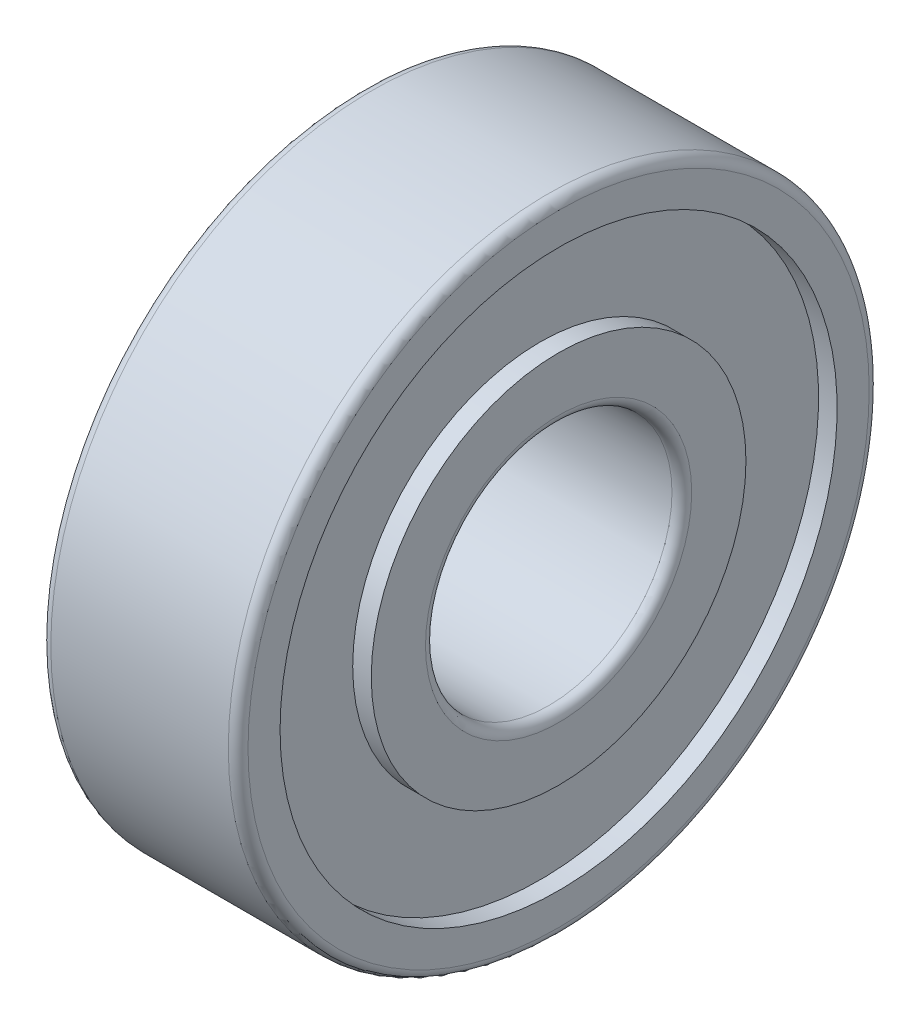
ISO-10303-21;
HEADER;
FILE_DESCRIPTION(('STEP AP214'),'2;1');
FILE_NAME('part.step','',(''),(''),'','','');
FILE_SCHEMA(('AUTOMOTIVE_DESIGN { 1 0 10303 214 1 1 1 1 }'));
ENDSEC;
DATA;
#1=APPLICATION_CONTEXT('core data for automotive mechanical design processes');
#2=APPLICATION_PROTOCOL_DEFINITION('international standard','automotive_design',2000,#1);
#3=PRODUCT_CONTEXT('',#1,'mechanical');
#4=PRODUCT('Part','Part','',(#3));
#5=PRODUCT_RELATED_PRODUCT_CATEGORY('part','',(#4));
#6=PRODUCT_DEFINITION_FORMATION('','',#4);
#7=PRODUCT_DEFINITION_CONTEXT('part definition',#1,'design');
#8=PRODUCT_DEFINITION('design','',#6,#7);
#9=PRODUCT_DEFINITION_SHAPE('','',#8);
#10=(LENGTH_UNIT() NAMED_UNIT(*) SI_UNIT(.MILLI.,.METRE.));
#11=(NAMED_UNIT(*) PLANE_ANGLE_UNIT() SI_UNIT($,.RADIAN.));
#12=(NAMED_UNIT(*) SI_UNIT($,.STERADIAN.) SOLID_ANGLE_UNIT());
#13=UNCERTAINTY_MEASURE_WITH_UNIT(LENGTH_MEASURE(1.E-05),#10,'distance_accuracy_value','');
#14=(GEOMETRIC_REPRESENTATION_CONTEXT(3) GLOBAL_UNCERTAINTY_ASSIGNED_CONTEXT((#13)) GLOBAL_UNIT_ASSIGNED_CONTEXT((#10,
#11,#12)) REPRESENTATION_CONTEXT('',''));
#15=CARTESIAN_POINT('',(0.,0.,0.));
#16=DIRECTION('',(0.,0.,1.));
#17=DIRECTION('',(1.,0.,0.));
#18=AXIS2_PLACEMENT_3D('',#15,#16,#17);
#19=CARTESIAN_POINT('',(0.200000000000017,0.,0.));
#20=DIRECTION('',(-1.,0.,0.));
#21=DIRECTION('',(0.,0.,1.));
#22=AXIS2_PLACEMENT_3D('',#19,#20,#21);
#23=TOROIDAL_SURFACE('',#22,6.29999999999998,0.200000000000017);
#24=CARTESIAN_POINT('',(0.,0.,0.));
#25=DIRECTION('',(-1.,0.,0.));
#26=DIRECTION('',(0.,0.,1.));
#27=AXIS2_PLACEMENT_3D('',#24,#25,#26);
#28=CIRCLE('',#27,6.3);
#29=CARTESIAN_POINT('',(0.,0.,6.3));
#30=VERTEX_POINT('',#29);
#31=EDGE_CURVE('E10',#30,#30,#28,.T.);
#32=ORIENTED_EDGE('',*,*,#31,.F.);
#33=EDGE_LOOP('',(#32));
#34=FACE_BOUND('',#33,.T.);
#35=CARTESIAN_POINT('',(0.2,0.,0.));
#36=DIRECTION('',(-1.,0.,0.));
#37=DIRECTION('',(0.,0.,1.));
#38=AXIS2_PLACEMENT_3D('',#35,#36,#37);
#39=CIRCLE('',#38,6.5);
#40=CARTESIAN_POINT('',(0.2,0.,6.5));
#41=VERTEX_POINT('',#40);
#42=EDGE_CURVE('E81',#41,#41,#39,.T.);
#43=ORIENTED_EDGE('',*,*,#42,.T.);
#44=EDGE_LOOP('',(#43));
#45=FACE_BOUND('',#44,.T.);
#46=ADVANCED_FACE('F29',(#34,#45),#23,.T.);
#47=CARTESIAN_POINT('',(0.,6.3,0.));
#48=DIRECTION('',(1.,0.,0.));
#49=DIRECTION('',(0.,0.,-1.));
#50=AXIS2_PLACEMENT_3D('',#47,#48,#49);
#51=PLANE('',#50);
#52=CARTESIAN_POINT('',(0.,0.,0.));
#53=DIRECTION('',(-1.,0.,0.));
#54=DIRECTION('',(0.,0.,1.));
#55=AXIS2_PLACEMENT_3D('',#52,#53,#54);
#56=CIRCLE('',#55,5.65);
#57=CARTESIAN_POINT('',(0.,0.,5.65));
#58=VERTEX_POINT('',#57);
#59=EDGE_CURVE('E35',#58,#58,#56,.T.);
#60=ORIENTED_EDGE('',*,*,#59,.F.);
#61=EDGE_LOOP('',(#60));
#62=FACE_BOUND('',#61,.T.);
#63=ORIENTED_EDGE('',*,*,#31,.T.);
#64=EDGE_LOOP('',(#63));
#65=FACE_BOUND('',#64,.T.);
#66=ADVANCED_FACE('F166',(#62,#65),#51,.F.);
#67=CARTESIAN_POINT('',(3.8,0.,0.));
#68=DIRECTION('',(-1.,0.,0.));
#69=DIRECTION('',(0.,0.,1.));
#70=AXIS2_PLACEMENT_3D('',#67,#68,#69);
#71=CYLINDRICAL_SURFACE('',#70,5.65);
#72=CARTESIAN_POINT('',(0.3765,0.,0.));
#73=DIRECTION('',(-1.,0.,0.));
#74=DIRECTION('',(0.,0.,1.));
#75=AXIS2_PLACEMENT_3D('',#72,#73,#74);
#76=CIRCLE('',#75,5.65);
#77=CARTESIAN_POINT('',(0.3765,0.,5.65));
#78=VERTEX_POINT('',#77);
#79=EDGE_CURVE('E39',#78,#78,#76,.T.);
#80=ORIENTED_EDGE('',*,*,#79,.F.);
#81=EDGE_LOOP('',(#80));
#82=FACE_BOUND('',#81,.T.);
#83=ORIENTED_EDGE('',*,*,#59,.T.);
#84=EDGE_LOOP('',(#83));
#85=FACE_BOUND('',#84,.T.);
#86=ADVANCED_FACE('F161',(#82,#85),#71,.F.);
#87=CARTESIAN_POINT('',(0.3765,5.65,0.));
#88=DIRECTION('',(1.,0.,0.));
#89=DIRECTION('',(0.,0.,-1.));
#90=AXIS2_PLACEMENT_3D('',#87,#88,#89);
#91=PLANE('',#90);
#92=CARTESIAN_POINT('',(0.3765,0.,0.));
#93=DIRECTION('',(-1.,0.,0.));
#94=DIRECTION('',(0.,0.,1.));
#95=AXIS2_PLACEMENT_3D('',#92,#93,#94);
#96=CIRCLE('',#95,3.8);
#97=CARTESIAN_POINT('',(0.3765,0.,3.8));
#98=VERTEX_POINT('',#97);
#99=EDGE_CURVE('E43',#98,#98,#96,.T.);
#100=ORIENTED_EDGE('',*,*,#99,.F.);
#101=EDGE_LOOP('',(#100));
#102=FACE_BOUND('',#101,.T.);
#103=ORIENTED_EDGE('',*,*,#79,.T.);
#104=EDGE_LOOP('',(#103));
#105=FACE_BOUND('',#104,.T.);
#106=ADVANCED_FACE('F155',(#102,#105),#91,.F.);
#107=CARTESIAN_POINT('',(3.8,0.,0.));
#108=DIRECTION('',(-1.,0.,0.));
#109=DIRECTION('',(0.,0.,1.));
#110=AXIS2_PLACEMENT_3D('',#107,#108,#109);
#111=CYLINDRICAL_SURFACE('',#110,3.8);
#112=CARTESIAN_POINT('',(0.,0.,0.));
#113=DIRECTION('',(-1.,0.,0.));
#114=DIRECTION('',(0.,0.,1.));
#115=AXIS2_PLACEMENT_3D('',#112,#113,#114);
#116=CIRCLE('',#115,3.8);
#117=CARTESIAN_POINT('',(0.,0.,3.8));
#118=VERTEX_POINT('',#117);
#119=EDGE_CURVE('E48',#118,#118,#116,.T.);
#120=ORIENTED_EDGE('',*,*,#119,.F.);
#121=EDGE_LOOP('',(#120));
#122=FACE_BOUND('',#121,.T.);
#123=ORIENTED_EDGE('',*,*,#99,.T.);
#124=EDGE_LOOP('',(#123));
#125=FACE_BOUND('',#124,.T.);
#126=ADVANCED_FACE('F149',(#122,#125),#111,.T.);
#127=CARTESIAN_POINT('',(0.,3.8,0.));
#128=DIRECTION('',(1.,0.,0.));
#129=DIRECTION('',(0.,0.,-1.));
#130=AXIS2_PLACEMENT_3D('',#127,#128,#129);
#131=PLANE('',#130);
#132=CARTESIAN_POINT('',(0.,0.,0.));
#133=DIRECTION('',(-1.,0.,0.));
#134=DIRECTION('',(0.,0.,1.));
#135=AXIS2_PLACEMENT_3D('',#132,#133,#134);
#136=CIRCLE('',#135,2.7);
#137=CARTESIAN_POINT('',(0.,0.,2.7));
#138=VERTEX_POINT('',#137);
#139=EDGE_CURVE('E51',#138,#138,#136,.T.);
#140=ORIENTED_EDGE('',*,*,#139,.F.);
#141=EDGE_LOOP('',(#140));
#142=FACE_BOUND('',#141,.T.);
#143=ORIENTED_EDGE('',*,*,#119,.T.);
#144=EDGE_LOOP('',(#143));
#145=FACE_BOUND('',#144,.T.);
#146=ADVANCED_FACE('F143',(#142,#145),#131,.F.);
#147=CARTESIAN_POINT('',(0.200000000000016,0.,0.));
#148=DIRECTION('',(-1.,0.,0.));
#149=DIRECTION('',(0.,0.,1.));
#150=AXIS2_PLACEMENT_3D('',#147,#148,#149);
#151=TOROIDAL_SURFACE('',#150,2.70000000000002,0.200000000000016);
#152=CARTESIAN_POINT('',(0.2,0.,0.));
#153=DIRECTION('',(-1.,0.,0.));
#154=DIRECTION('',(0.,0.,1.));
#155=AXIS2_PLACEMENT_3D('',#152,#153,#154);
#156=CIRCLE('',#155,2.5);
#157=CARTESIAN_POINT('',(0.2,0.,2.5));
#158=VERTEX_POINT('',#157);
#159=EDGE_CURVE('E54',#158,#158,#156,.T.);
#160=ORIENTED_EDGE('',*,*,#159,.F.);
#161=EDGE_LOOP('',(#160));
#162=FACE_BOUND('',#161,.T.);
#163=ORIENTED_EDGE('',*,*,#139,.T.);
#164=EDGE_LOOP('',(#163));
#165=FACE_BOUND('',#164,.T.);
#166=ADVANCED_FACE('F137',(#162,#165),#151,.T.);
#167=CARTESIAN_POINT('',(3.8,0.,0.));
#168=DIRECTION('',(-1.,0.,0.));
#169=DIRECTION('',(0.,0.,1.));
#170=AXIS2_PLACEMENT_3D('',#167,#168,#169);
#171=CYLINDRICAL_SURFACE('',#170,2.5);
#172=CARTESIAN_POINT('',(3.8,0.,0.));
#173=DIRECTION('',(-1.,0.,0.));
#174=DIRECTION('',(0.,0.,1.));
#175=AXIS2_PLACEMENT_3D('',#172,#173,#174);
#176=CIRCLE('',#175,2.5);
#177=CARTESIAN_POINT('',(3.8,0.,2.5));
#178=VERTEX_POINT('',#177);
#179=EDGE_CURVE('E57',#178,#178,#176,.T.);
#180=ORIENTED_EDGE('',*,*,#179,.F.);
#181=EDGE_LOOP('',(#180));
#182=FACE_BOUND('',#181,.T.);
#183=ORIENTED_EDGE('',*,*,#159,.T.);
#184=EDGE_LOOP('',(#183));
#185=FACE_BOUND('',#184,.T.);
#186=ADVANCED_FACE('F131',(#182,#185),#171,.F.);
#187=CARTESIAN_POINT('',(3.79999999999997,0.,0.));
#188=DIRECTION('',(-1.,0.,0.));
#189=DIRECTION('',(0.,0.,1.));
#190=AXIS2_PLACEMENT_3D('',#187,#188,#189);
#191=TOROIDAL_SURFACE('',#190,2.70000000000003,0.200000000000032);
#192=CARTESIAN_POINT('',(4.,0.,0.));
#193=DIRECTION('',(-1.,0.,0.));
#194=DIRECTION('',(0.,0.,1.));
#195=AXIS2_PLACEMENT_3D('',#192,#193,#194);
#196=CIRCLE('',#195,2.7);
#197=CARTESIAN_POINT('',(4.,0.,2.7));
#198=VERTEX_POINT('',#197);
#199=EDGE_CURVE('E60',#198,#198,#196,.T.);
#200=ORIENTED_EDGE('',*,*,#199,.F.);
#201=EDGE_LOOP('',(#200));
#202=FACE_BOUND('',#201,.T.);
#203=ORIENTED_EDGE('',*,*,#179,.T.);
#204=EDGE_LOOP('',(#203));
#205=FACE_BOUND('',#204,.T.);
#206=ADVANCED_FACE('F125',(#202,#205),#191,.T.);
#207=CARTESIAN_POINT('',(4.,2.7,0.));
#208=DIRECTION('',(-1.,0.,0.));
#209=DIRECTION('',(0.,0.,1.));
#210=AXIS2_PLACEMENT_3D('',#207,#208,#209);
#211=PLANE('',#210);
#212=CARTESIAN_POINT('',(4.,0.,0.));
#213=DIRECTION('',(-1.,0.,0.));
#214=DIRECTION('',(0.,0.,1.));
#215=AXIS2_PLACEMENT_3D('',#212,#213,#214);
#216=CIRCLE('',#215,3.8);
#217=CARTESIAN_POINT('',(4.,0.,3.8));
#218=VERTEX_POINT('',#217);
#219=EDGE_CURVE('E63',#218,#218,#216,.T.);
#220=ORIENTED_EDGE('',*,*,#219,.F.);
#221=EDGE_LOOP('',(#220));
#222=FACE_BOUND('',#221,.T.);
#223=ORIENTED_EDGE('',*,*,#199,.T.);
#224=EDGE_LOOP('',(#223));
#225=FACE_BOUND('',#224,.T.);
#226=ADVANCED_FACE('F119',(#222,#225),#211,.F.);
#227=CARTESIAN_POINT('',(3.8,0.,0.));
#228=DIRECTION('',(-1.,0.,0.));
#229=DIRECTION('',(0.,0.,1.));
#230=AXIS2_PLACEMENT_3D('',#227,#228,#229);
#231=CYLINDRICAL_SURFACE('',#230,3.8);
#232=CARTESIAN_POINT('',(3.6235,0.,0.));
#233=DIRECTION('',(-1.,0.,0.));
#234=DIRECTION('',(0.,0.,1.));
#235=AXIS2_PLACEMENT_3D('',#232,#233,#234);
#236=CIRCLE('',#235,3.8);
#237=CARTESIAN_POINT('',(3.6235,0.,3.8));
#238=VERTEX_POINT('',#237);
#239=EDGE_CURVE('E66',#238,#238,#236,.T.);
#240=ORIENTED_EDGE('',*,*,#239,.F.);
#241=EDGE_LOOP('',(#240));
#242=FACE_BOUND('',#241,.T.);
#243=ORIENTED_EDGE('',*,*,#219,.T.);
#244=EDGE_LOOP('',(#243));
#245=FACE_BOUND('',#244,.T.);
#246=ADVANCED_FACE('F113',(#242,#245),#231,.T.);
#247=CARTESIAN_POINT('',(3.6235,3.8,0.));
#248=DIRECTION('',(-1.,0.,0.));
#249=DIRECTION('',(0.,0.,1.));
#250=AXIS2_PLACEMENT_3D('',#247,#248,#249);
#251=PLANE('',#250);
#252=CARTESIAN_POINT('',(3.6235,0.,0.));
#253=DIRECTION('',(-1.,0.,0.));
#254=DIRECTION('',(0.,0.,1.));
#255=AXIS2_PLACEMENT_3D('',#252,#253,#254);
#256=CIRCLE('',#255,5.65);
#257=CARTESIAN_POINT('',(3.6235,0.,5.65));
#258=VERTEX_POINT('',#257);
#259=EDGE_CURVE('E69',#258,#258,#256,.T.);
#260=ORIENTED_EDGE('',*,*,#259,.F.);
#261=EDGE_LOOP('',(#260));
#262=FACE_BOUND('',#261,.T.);
#263=ORIENTED_EDGE('',*,*,#239,.T.);
#264=EDGE_LOOP('',(#263));
#265=FACE_BOUND('',#264,.T.);
#266=ADVANCED_FACE('F107',(#262,#265),#251,.F.);
#267=CARTESIAN_POINT('',(3.8,0.,0.));
#268=DIRECTION('',(-1.,0.,0.));
#269=DIRECTION('',(0.,0.,1.));
#270=AXIS2_PLACEMENT_3D('',#267,#268,#269);
#271=CYLINDRICAL_SURFACE('',#270,5.65);
#272=CARTESIAN_POINT('',(4.,0.,0.));
#273=DIRECTION('',(-1.,0.,0.));
#274=DIRECTION('',(0.,0.,1.));
#275=AXIS2_PLACEMENT_3D('',#272,#273,#274);
#276=CIRCLE('',#275,5.65);
#277=CARTESIAN_POINT('',(4.,0.,5.65));
#278=VERTEX_POINT('',#277);
#279=EDGE_CURVE('E72',#278,#278,#276,.T.);
#280=ORIENTED_EDGE('',*,*,#279,.F.);
#281=EDGE_LOOP('',(#280));
#282=FACE_BOUND('',#281,.T.);
#283=ORIENTED_EDGE('',*,*,#259,.T.);
#284=EDGE_LOOP('',(#283));
#285=FACE_BOUND('',#284,.T.);
#286=ADVANCED_FACE('F101',(#282,#285),#271,.F.);
#287=CARTESIAN_POINT('',(4.,5.65,0.));
#288=DIRECTION('',(-1.,0.,0.));
#289=DIRECTION('',(0.,0.,1.));
#290=AXIS2_PLACEMENT_3D('',#287,#288,#289);
#291=PLANE('',#290);
#292=CARTESIAN_POINT('',(4.,0.,0.));
#293=DIRECTION('',(-1.,0.,0.));
#294=DIRECTION('',(0.,0.,1.));
#295=AXIS2_PLACEMENT_3D('',#292,#293,#294);
#296=CIRCLE('',#295,6.3);
#297=CARTESIAN_POINT('',(4.,0.,6.3));
#298=VERTEX_POINT('',#297);
#299=EDGE_CURVE('E75',#298,#298,#296,.T.);
#300=ORIENTED_EDGE('',*,*,#299,.F.);
#301=EDGE_LOOP('',(#300));
#302=FACE_BOUND('',#301,.T.);
#303=ORIENTED_EDGE('',*,*,#279,.T.);
#304=EDGE_LOOP('',(#303));
#305=FACE_BOUND('',#304,.T.);
#306=ADVANCED_FACE('F95',(#302,#305),#291,.F.);
#307=CARTESIAN_POINT('',(3.79999999999997,0.,0.));
#308=DIRECTION('',(-1.,0.,0.));
#309=DIRECTION('',(0.,0.,1.));
#310=AXIS2_PLACEMENT_3D('',#307,#308,#309);
#311=TOROIDAL_SURFACE('',#310,6.29999999999997,0.200000000000033);
#312=CARTESIAN_POINT('',(3.8,0.,0.));
#313=DIRECTION('',(-1.,0.,0.));
#314=DIRECTION('',(0.,0.,1.));
#315=AXIS2_PLACEMENT_3D('',#312,#313,#314);
#316=CIRCLE('',#315,6.5);
#317=CARTESIAN_POINT('',(3.8,0.,6.5));
#318=VERTEX_POINT('',#317);
#319=EDGE_CURVE('E78',#318,#318,#316,.T.);
#320=ORIENTED_EDGE('',*,*,#319,.F.);
#321=EDGE_LOOP('',(#320));
#322=FACE_BOUND('',#321,.T.);
#323=ORIENTED_EDGE('',*,*,#299,.T.);
#324=EDGE_LOOP('',(#323));
#325=FACE_BOUND('',#324,.T.);
#326=ADVANCED_FACE('F89',(#322,#325),#311,.T.);
#327=CARTESIAN_POINT('',(3.8,0.,0.));
#328=DIRECTION('',(-1.,0.,0.));
#329=DIRECTION('',(0.,0.,1.));
#330=AXIS2_PLACEMENT_3D('',#327,#328,#329);
#331=CYLINDRICAL_SURFACE('',#330,6.5);
#332=ORIENTED_EDGE('',*,*,#42,.F.);
#333=EDGE_LOOP('',(#332));
#334=FACE_BOUND('',#333,.T.);
#335=ORIENTED_EDGE('',*,*,#319,.T.);
#336=EDGE_LOOP('',(#335));
#337=FACE_BOUND('',#336,.T.);
#338=ADVANCED_FACE('F86',(#334,#337),#331,.T.);
#339=CLOSED_SHELL('',(#46,#66,#86,#106,#126,#146,#166,#186,#206,#226,#246,#266,#286,#306,#326,#338));
#340=MANIFOLD_SOLID_BREP('B2',#339);
#341=ADVANCED_BREP_SHAPE_REPRESENTATION('',(#18,#340),#14);
#342=SHAPE_DEFINITION_REPRESENTATION(#9,#341);
ENDSEC;
END-ISO-10303-21;
